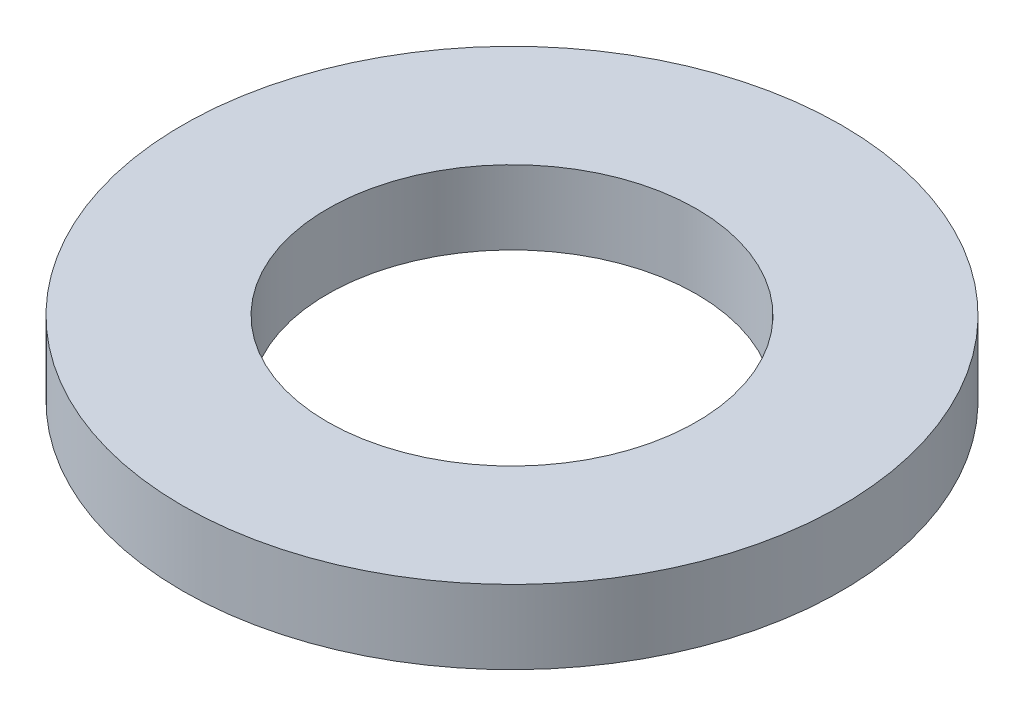
ISO-10303-21;
HEADER;
FILE_DESCRIPTION(('STEP AP214'),'2;1');
FILE_NAME('part.step','',(''),(''),'','','');
FILE_SCHEMA(('AUTOMOTIVE_DESIGN { 1 0 10303 214 1 1 1 1 }'));
ENDSEC;
DATA;
#1=APPLICATION_CONTEXT('core data for automotive mechanical design processes');
#2=APPLICATION_PROTOCOL_DEFINITION('international standard','automotive_design',2000,#1);
#3=PRODUCT_CONTEXT('',#1,'mechanical');
#4=PRODUCT('Part','Part','',(#3));
#5=PRODUCT_RELATED_PRODUCT_CATEGORY('part','',(#4));
#6=PRODUCT_DEFINITION_FORMATION('','',#4);
#7=PRODUCT_DEFINITION_CONTEXT('part definition',#1,'design');
#8=PRODUCT_DEFINITION('design','',#6,#7);
#9=PRODUCT_DEFINITION_SHAPE('','',#8);
#10=(LENGTH_UNIT() NAMED_UNIT(*) SI_UNIT(.MILLI.,.METRE.));
#11=(NAMED_UNIT(*) PLANE_ANGLE_UNIT() SI_UNIT($,.RADIAN.));
#12=(NAMED_UNIT(*) SI_UNIT($,.STERADIAN.) SOLID_ANGLE_UNIT());
#13=UNCERTAINTY_MEASURE_WITH_UNIT(LENGTH_MEASURE(1.E-05),#10,'distance_accuracy_value','');
#14=(GEOMETRIC_REPRESENTATION_CONTEXT(3) GLOBAL_UNCERTAINTY_ASSIGNED_CONTEXT((#13)) GLOBAL_UNIT_ASSIGNED_CONTEXT((#10,
#11,#12)) REPRESENTATION_CONTEXT('',''));
#15=CARTESIAN_POINT('',(0.,0.,0.));
#16=DIRECTION('',(0.,0.,1.));
#17=DIRECTION('',(1.,0.,0.));
#18=AXIS2_PLACEMENT_3D('',#15,#16,#17);
#19=CARTESIAN_POINT('',(0.,14.,0.));
#20=DIRECTION('',(0.,-1.,0.));
#21=DIRECTION('',(0.,0.,-1.));
#22=AXIS2_PLACEMENT_3D('',#19,#20,#21);
#23=CYLINDRICAL_SURFACE('',#22,62.5);
#24=CARTESIAN_POINT('',(0.,14.,0.));
#25=DIRECTION('',(0.,1.,0.));
#26=DIRECTION('',(0.,0.,1.));
#27=AXIS2_PLACEMENT_3D('',#24,#25,#26);
#28=CIRCLE('',#27,62.5);
#29=CARTESIAN_POINT('',(0.,14.,62.5));
#30=VERTEX_POINT('',#29);
#31=EDGE_CURVE('E10',#30,#30,#28,.T.);
#32=ORIENTED_EDGE('',*,*,#31,.F.);
#33=EDGE_LOOP('',(#32));
#34=FACE_BOUND('',#33,.T.);
#35=CARTESIAN_POINT('',(0.,0.,0.));
#36=DIRECTION('',(0.,1.,0.));
#37=DIRECTION('',(0.,0.,1.));
#38=AXIS2_PLACEMENT_3D('',#35,#36,#37);
#39=CIRCLE('',#38,62.5);
#40=CARTESIAN_POINT('',(0.,0.,62.5));
#41=VERTEX_POINT('',#40);
#42=EDGE_CURVE('E37',#41,#41,#39,.T.);
#43=ORIENTED_EDGE('',*,*,#42,.T.);
#44=EDGE_LOOP('',(#43));
#45=FACE_BOUND('',#44,.T.);
#46=ADVANCED_FACE('F40',(#34,#45),#23,.T.);
#47=CARTESIAN_POINT('',(0.,14.,0.));
#48=DIRECTION('',(0.,1.,0.));
#49=DIRECTION('',(0.,0.,1.));
#50=AXIS2_PLACEMENT_3D('',#47,#48,#49);
#51=PLANE('',#50);
#52=CARTESIAN_POINT('',(0.,14.,0.));
#53=DIRECTION('',(0.,1.,0.));
#54=DIRECTION('',(0.,0.,1.));
#55=AXIS2_PLACEMENT_3D('',#52,#53,#54);
#56=CIRCLE('',#55,35.);
#57=CARTESIAN_POINT('',(0.,14.,35.));
#58=VERTEX_POINT('',#57);
#59=EDGE_CURVE('E50',#58,#58,#56,.T.);
#60=ORIENTED_EDGE('',*,*,#59,.F.);
#61=EDGE_LOOP('',(#60));
#62=FACE_BOUND('',#61,.T.);
#63=ORIENTED_EDGE('',*,*,#31,.T.);
#64=EDGE_LOOP('',(#63));
#65=FACE_BOUND('',#64,.T.);
#66=ADVANCED_FACE('F59',(#62,#65),#51,.T.);
#67=CARTESIAN_POINT('',(0.,0.,0.));
#68=DIRECTION('',(0.,1.,0.));
#69=DIRECTION('',(0.,0.,1.));
#70=AXIS2_PLACEMENT_3D('',#67,#68,#69);
#71=PLANE('',#70);
#72=CARTESIAN_POINT('',(0.,0.,0.));
#73=DIRECTION('',(0.,1.,0.));
#74=DIRECTION('',(0.,0.,1.));
#75=AXIS2_PLACEMENT_3D('',#72,#73,#74);
#76=CIRCLE('',#75,35.);
#77=CARTESIAN_POINT('',(0.,0.,35.));
#78=VERTEX_POINT('',#77);
#79=EDGE_CURVE('E47',#78,#78,#76,.T.);
#80=ORIENTED_EDGE('',*,*,#79,.T.);
#81=EDGE_LOOP('',(#80));
#82=FACE_BOUND('',#81,.T.);
#83=ORIENTED_EDGE('',*,*,#42,.F.);
#84=EDGE_LOOP('',(#83));
#85=FACE_BOUND('',#84,.T.);
#86=ADVANCED_FACE('F58',(#82,#85),#71,.F.);
#87=CARTESIAN_POINT('',(0.,14.,0.));
#88=DIRECTION('',(0.,-1.,0.));
#89=DIRECTION('',(0.,0.,-1.));
#90=AXIS2_PLACEMENT_3D('',#87,#88,#89);
#91=CYLINDRICAL_SURFACE('',#90,35.);
#92=ORIENTED_EDGE('',*,*,#59,.T.);
#93=EDGE_LOOP('',(#92));
#94=FACE_BOUND('',#93,.T.);
#95=ORIENTED_EDGE('',*,*,#79,.F.);
#96=EDGE_LOOP('',(#95));
#97=FACE_BOUND('',#96,.T.);
#98=ADVANCED_FACE('F54',(#94,#97),#91,.F.);
#99=CLOSED_SHELL('',(#46,#66,#86,#98));
#100=MANIFOLD_SOLID_BREP('B2',#99);
#101=ADVANCED_BREP_SHAPE_REPRESENTATION('',(#18,#100),#14);
#102=SHAPE_DEFINITION_REPRESENTATION(#9,#101);
ENDSEC;
END-ISO-10303-21;
